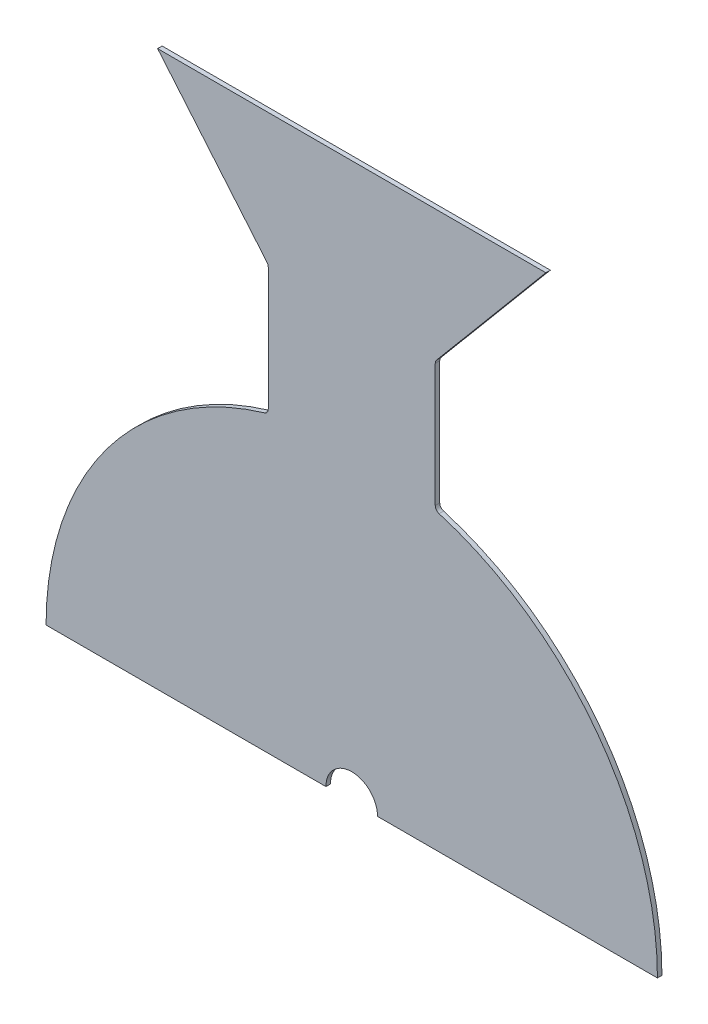
ISO-10303-21;
HEADER;
FILE_DESCRIPTION(('STEP AP214'),'2;1');
FILE_NAME('part.step','',(''),(''),'','','');
FILE_SCHEMA(('AUTOMOTIVE_DESIGN { 1 0 10303 214 1 1 1 1 }'));
ENDSEC;
DATA;
#1=APPLICATION_CONTEXT('core data for automotive mechanical design processes');
#2=APPLICATION_PROTOCOL_DEFINITION('international standard','automotive_design',2000,#1);
#3=PRODUCT_CONTEXT('',#1,'mechanical');
#4=PRODUCT('Part','Part','',(#3));
#5=PRODUCT_RELATED_PRODUCT_CATEGORY('part','',(#4));
#6=PRODUCT_DEFINITION_FORMATION('','',#4);
#7=PRODUCT_DEFINITION_CONTEXT('part definition',#1,'design');
#8=PRODUCT_DEFINITION('design','',#6,#7);
#9=PRODUCT_DEFINITION_SHAPE('','',#8);
#10=(LENGTH_UNIT() NAMED_UNIT(*) SI_UNIT(.MILLI.,.METRE.));
#11=(NAMED_UNIT(*) PLANE_ANGLE_UNIT() SI_UNIT($,.RADIAN.));
#12=(NAMED_UNIT(*) SI_UNIT($,.STERADIAN.) SOLID_ANGLE_UNIT());
#13=UNCERTAINTY_MEASURE_WITH_UNIT(LENGTH_MEASURE(1.E-05),#10,'distance_accuracy_value','');
#14=(GEOMETRIC_REPRESENTATION_CONTEXT(3) GLOBAL_UNCERTAINTY_ASSIGNED_CONTEXT((#13)) GLOBAL_UNIT_ASSIGNED_CONTEXT((#10,
#11,#12)) REPRESENTATION_CONTEXT('',''));
#15=CARTESIAN_POINT('',(0.,0.,0.));
#16=DIRECTION('',(0.,0.,1.));
#17=DIRECTION('',(1.,0.,0.));
#18=AXIS2_PLACEMENT_3D('',#15,#16,#17);
#19=CARTESIAN_POINT('',(0.,0.,-2.65684));
#20=DIRECTION('',(0.,0.,1.));
#21=DIRECTION('',(1.,0.,0.));
#22=AXIS2_PLACEMENT_3D('',#19,#20,#21);
#23=CYLINDRICAL_SURFACE('',#22,180.45684);
#24=CARTESIAN_POINT('',(0.,0.,0.));
#25=DIRECTION('',(0.,0.,1.));
#26=DIRECTION('',(-1.,0.,0.));
#27=AXIS2_PLACEMENT_3D('',#24,#25,#26);
#28=CIRCLE('',#27,180.45684);
#29=CARTESIAN_POINT('',(-51.5590971428571,172.934469104916,0.));
#30=VERTEX_POINT('',#29);
#31=CARTESIAN_POINT('',(-180.45684,0.,0.));
#32=VERTEX_POINT('',#31);
#33=EDGE_CURVE('E182',#30,#32,#28,.T.);
#34=ORIENTED_EDGE('',*,*,#33,.F.);
#35=DIRECTION('',(0.,0.,1.));
#36=VECTOR('',#35,1.);
#37=CARTESIAN_POINT('',(-51.5590971428571,172.934469104916,-2.65684));
#38=LINE('',#37,#36);
#39=CARTESIAN_POINT('',(-51.5590971428571,172.934469104916,-2.65684));
#40=VERTEX_POINT('',#39);
#41=EDGE_CURVE('E55',#30,#40,#38,.F.);
#42=ORIENTED_EDGE('',*,*,#41,.T.);
#43=CARTESIAN_POINT('',(0.,0.,-2.65684));
#44=DIRECTION('',(0.,0.,1.));
#45=DIRECTION('',(-1.,0.,0.));
#46=AXIS2_PLACEMENT_3D('',#43,#44,#45);
#47=CIRCLE('',#46,180.45684);
#48=CARTESIAN_POINT('',(-180.45684,0.,-2.65684));
#49=VERTEX_POINT('',#48);
#50=EDGE_CURVE('E137',#40,#49,#47,.T.);
#51=ORIENTED_EDGE('',*,*,#50,.T.);
#52=DIRECTION('',(0.,0.,1.));
#53=VECTOR('',#52,1.);
#54=CARTESIAN_POINT('',(-180.45684,0.,-2.65684));
#55=LINE('',#54,#53);
#56=EDGE_CURVE('E139',#49,#32,#55,.T.);
#57=ORIENTED_EDGE('',*,*,#56,.T.);
#58=EDGE_LOOP('',(#34,#42,#51,#57));
#59=FACE_BOUND('',#58,.T.);
#60=ADVANCED_FACE('F40',(#59),#23,.T.);
#61=CARTESIAN_POINT('',(-49.29124,173.594483674015,-2.65684));
#62=DIRECTION('',(-1.,0.,0.));
#63=DIRECTION('',(0.,0.,1.));
#64=AXIS2_PLACEMENT_3D('',#61,#62,#63);
#65=PLANE('',#64);
#66=DIRECTION('',(0.,-1.,0.));
#67=VECTOR('',#66,1.);
#68=CARTESIAN_POINT('',(-49.29124,173.594483674015,0.));
#69=LINE('',#68,#67);
#70=CARTESIAN_POINT('',(-49.29124,248.63887818022,0.));
#71=VERTEX_POINT('',#70);
#72=CARTESIAN_POINT('',(-49.29124,175.977118745728,0.));
#73=VERTEX_POINT('',#72);
#74=EDGE_CURVE('E145',#71,#73,#69,.T.);
#75=ORIENTED_EDGE('',*,*,#74,.F.);
#76=DIRECTION('',(0.,0.,1.));
#77=VECTOR('',#76,1.);
#78=CARTESIAN_POINT('',(-49.29124,248.63887818022,-2.65684));
#79=LINE('',#78,#77);
#80=CARTESIAN_POINT('',(-49.29124,248.63887818022,-2.65684));
#81=VERTEX_POINT('',#80);
#82=EDGE_CURVE('E222',#71,#81,#79,.F.);
#83=ORIENTED_EDGE('',*,*,#82,.T.);
#84=DIRECTION('',(0.,-1.,0.));
#85=VECTOR('',#84,1.);
#86=CARTESIAN_POINT('',(-49.29124,173.594483674015,-2.65684));
#87=LINE('',#86,#85);
#88=CARTESIAN_POINT('',(-49.29124,175.977118745728,-2.65684));
#89=VERTEX_POINT('',#88);
#90=EDGE_CURVE('E153',#81,#89,#87,.T.);
#91=ORIENTED_EDGE('',*,*,#90,.T.);
#92=DIRECTION('',(0.,0.,-1.));
#93=VECTOR('',#92,1.);
#94=CARTESIAN_POINT('',(-49.29124,175.977118745728,0.));
#95=LINE('',#94,#93);
#96=EDGE_CURVE('E219',#89,#73,#95,.F.);
#97=ORIENTED_EDGE('',*,*,#96,.T.);
#98=EDGE_LOOP('',(#75,#83,#91,#97));
#99=FACE_BOUND('',#98,.T.);
#100=ADVANCED_FACE('F279',(#99),#65,.T.);
#101=CARTESIAN_POINT('',(-49.29124,249.794483674015,-2.65684));
#102=DIRECTION('',(-0.766044443118977,-0.642787609686541,0.));
#103=DIRECTION('',(0.642787609686541,-0.766044443118977,0.));
#104=AXIS2_PLACEMENT_3D('',#101,#102,#103);
#105=PLANE('',#104);
#106=DIRECTION('',(0.642787609686541,-0.766044443118977,0.));
#107=VECTOR('',#106,1.);
#108=CARTESIAN_POINT('',(-49.29124,249.794483674015,-2.65684));
#109=LINE('',#108,#107);
#110=CARTESIAN_POINT('',(-114.598461144153,327.624599094903,-2.65684));
#111=VERTEX_POINT('',#110);
#112=CARTESIAN_POINT('',(-50.0340488930973,250.679728840975,-2.65684));
#113=VERTEX_POINT('',#112);
#114=EDGE_CURVE('E177',#111,#113,#109,.T.);
#115=ORIENTED_EDGE('',*,*,#114,.T.);
#116=DIRECTION('',(0.,0.,1.));
#117=VECTOR('',#116,1.);
#118=CARTESIAN_POINT('',(-50.0340488930972,250.679728840975,0.));
#119=LINE('',#118,#117);
#120=CARTESIAN_POINT('',(-50.0340488930973,250.679728840975,0.));
#121=VERTEX_POINT('',#120);
#122=EDGE_CURVE('E208',#113,#121,#119,.T.);
#123=ORIENTED_EDGE('',*,*,#122,.T.);
#124=DIRECTION('',(0.642787609686541,-0.766044443118977,0.));
#125=VECTOR('',#124,1.);
#126=CARTESIAN_POINT('',(-49.29124,249.794483674015,0.));
#127=LINE('',#126,#125);
#128=CARTESIAN_POINT('',(-114.598461144153,327.624599094903,0.));
#129=VERTEX_POINT('',#128);
#130=EDGE_CURVE('E202',#129,#121,#127,.T.);
#131=ORIENTED_EDGE('',*,*,#130,.F.);
#132=DIRECTION('',(0.,0.,1.));
#133=VECTOR('',#132,1.);
#134=CARTESIAN_POINT('',(-114.598461144153,327.624599094903,-2.65684));
#135=LINE('',#134,#133);
#136=EDGE_CURVE('E206',#111,#129,#135,.T.);
#137=ORIENTED_EDGE('',*,*,#136,.F.);
#138=EDGE_LOOP('',(#115,#123,#131,#137));
#139=FACE_BOUND('',#138,.T.);
#140=ADVANCED_FACE('F270',(#139),#105,.T.);
#141=CARTESIAN_POINT('',(-114.598461144153,327.624599094903,-2.65684));
#142=DIRECTION('',(0.,1.,0.));
#143=DIRECTION('',(0.,0.,1.));
#144=AXIS2_PLACEMENT_3D('',#141,#142,#143);
#145=PLANE('',#144);
#146=DIRECTION('',(-1.,0.,0.));
#147=VECTOR('',#146,1.);
#148=CARTESIAN_POINT('',(-114.598461144153,327.624599094903,0.));
#149=LINE('',#148,#147);
#150=CARTESIAN_POINT('',(114.598461144153,327.624599094903,0.));
#151=VERTEX_POINT('',#150);
#152=EDGE_CURVE('E199',#151,#129,#149,.T.);
#153=ORIENTED_EDGE('',*,*,#152,.F.);
#154=DIRECTION('',(0.,0.,1.));
#155=VECTOR('',#154,1.);
#156=CARTESIAN_POINT('',(114.598461144153,327.624599094903,-2.65684));
#157=LINE('',#156,#155);
#158=CARTESIAN_POINT('',(114.598461144153,327.624599094903,-2.65684));
#159=VERTEX_POINT('',#158);
#160=EDGE_CURVE('E209',#159,#151,#157,.T.);
#161=ORIENTED_EDGE('',*,*,#160,.F.);
#162=DIRECTION('',(-1.,0.,0.));
#163=VECTOR('',#162,1.);
#164=CARTESIAN_POINT('',(-114.598461144153,327.624599094903,-2.65684));
#165=LINE('',#164,#163);
#166=EDGE_CURVE('E174',#159,#111,#165,.T.);
#167=ORIENTED_EDGE('',*,*,#166,.T.);
#168=ORIENTED_EDGE('',*,*,#136,.T.);
#169=EDGE_LOOP('',(#153,#161,#167,#168));
#170=FACE_BOUND('',#169,.T.);
#171=ADVANCED_FACE('F266',(#170),#145,.T.);
#172=CARTESIAN_POINT('',(49.29124,249.794483674015,-2.65684));
#173=DIRECTION('',(0.766044443118977,-0.642787609686541,0.));
#174=DIRECTION('',(0.642787609686541,0.766044443118977,0.));
#175=AXIS2_PLACEMENT_3D('',#172,#173,#174);
#176=PLANE('',#175);
#177=DIRECTION('',(0.642787609686541,0.766044443118977,0.));
#178=VECTOR('',#177,1.);
#179=CARTESIAN_POINT('',(49.29124,249.794483674015,0.));
#180=LINE('',#179,#178);
#181=CARTESIAN_POINT('',(50.0340488930973,250.679728840975,0.));
#182=VERTEX_POINT('',#181);
#183=EDGE_CURVE('E197',#182,#151,#180,.T.);
#184=ORIENTED_EDGE('',*,*,#183,.F.);
#185=DIRECTION('',(0.,0.,1.));
#186=VECTOR('',#185,1.);
#187=CARTESIAN_POINT('',(50.0340488930972,250.679728840975,-2.65684));
#188=LINE('',#187,#186);
#189=CARTESIAN_POINT('',(50.0340488930973,250.679728840975,-2.65684));
#190=VERTEX_POINT('',#189);
#191=EDGE_CURVE('E232',#182,#190,#188,.F.);
#192=ORIENTED_EDGE('',*,*,#191,.T.);
#193=DIRECTION('',(0.642787609686541,0.766044443118977,0.));
#194=VECTOR('',#193,1.);
#195=CARTESIAN_POINT('',(49.29124,249.794483674015,-2.65684));
#196=LINE('',#195,#194);
#197=EDGE_CURVE('E172',#190,#159,#196,.T.);
#198=ORIENTED_EDGE('',*,*,#197,.T.);
#199=ORIENTED_EDGE('',*,*,#160,.T.);
#200=EDGE_LOOP('',(#184,#192,#198,#199));
#201=FACE_BOUND('',#200,.T.);
#202=ADVANCED_FACE('F262',(#201),#176,.T.);
#203=CARTESIAN_POINT('',(49.29124,173.594483674015,-2.65684));
#204=DIRECTION('',(1.,0.,0.));
#205=DIRECTION('',(0.,0.,-1.));
#206=AXIS2_PLACEMENT_3D('',#203,#204,#205);
#207=PLANE('',#206);
#208=DIRECTION('',(0.,1.,0.));
#209=VECTOR('',#208,1.);
#210=CARTESIAN_POINT('',(49.29124,173.594483674015,0.));
#211=LINE('',#210,#209);
#212=CARTESIAN_POINT('',(49.29124,175.977118745728,0.));
#213=VERTEX_POINT('',#212);
#214=CARTESIAN_POINT('',(49.29124,248.63887818022,0.));
#215=VERTEX_POINT('',#214);
#216=EDGE_CURVE('E194',#213,#215,#211,.T.);
#217=ORIENTED_EDGE('',*,*,#216,.F.);
#218=DIRECTION('',(0.,0.,-1.));
#219=VECTOR('',#218,1.);
#220=CARTESIAN_POINT('',(49.29124,175.977118745728,-2.65684));
#221=LINE('',#220,#219);
#222=CARTESIAN_POINT('',(49.29124,175.977118745728,-2.65684));
#223=VERTEX_POINT('',#222);
#224=EDGE_CURVE('E230',#213,#223,#221,.T.);
#225=ORIENTED_EDGE('',*,*,#224,.T.);
#226=DIRECTION('',(0.,1.,0.));
#227=VECTOR('',#226,1.);
#228=CARTESIAN_POINT('',(49.29124,173.594483674015,-2.65684));
#229=LINE('',#228,#227);
#230=CARTESIAN_POINT('',(49.29124,248.63887818022,-2.65684));
#231=VERTEX_POINT('',#230);
#232=EDGE_CURVE('E169',#223,#231,#229,.T.);
#233=ORIENTED_EDGE('',*,*,#232,.T.);
#234=DIRECTION('',(0.,0.,1.));
#235=VECTOR('',#234,1.);
#236=CARTESIAN_POINT('',(49.29124,248.63887818022,0.));
#237=LINE('',#236,#235);
#238=EDGE_CURVE('E227',#231,#215,#237,.T.);
#239=ORIENTED_EDGE('',*,*,#238,.T.);
#240=EDGE_LOOP('',(#217,#225,#233,#239));
#241=FACE_BOUND('',#240,.T.);
#242=ADVANCED_FACE('F256',(#241),#207,.T.);
#243=CARTESIAN_POINT('',(0.,0.,-2.65684));
#244=DIRECTION('',(0.,0.,1.));
#245=DIRECTION('',(1.,0.,0.));
#246=AXIS2_PLACEMENT_3D('',#243,#244,#245);
#247=CYLINDRICAL_SURFACE('',#246,180.45684);
#248=CARTESIAN_POINT('',(0.,0.,-2.65684));
#249=DIRECTION('',(0.,0.,1.));
#250=DIRECTION('',(-1.,0.,0.));
#251=AXIS2_PLACEMENT_3D('',#248,#249,#250);
#252=CIRCLE('',#251,180.45684);
#253=CARTESIAN_POINT('',(180.45684,0.,-2.65684));
#254=VERTEX_POINT('',#253);
#255=CARTESIAN_POINT('',(51.5590971428571,172.934469104916,-2.65684));
#256=VERTEX_POINT('',#255);
#257=EDGE_CURVE('E166',#254,#256,#252,.T.);
#258=ORIENTED_EDGE('',*,*,#257,.T.);
#259=DIRECTION('',(0.,0.,1.));
#260=VECTOR('',#259,1.);
#261=CARTESIAN_POINT('',(51.5590971428571,172.934469104916,-2.65684));
#262=LINE('',#261,#260);
#263=CARTESIAN_POINT('',(51.5590971428571,172.934469104916,0.));
#264=VERTEX_POINT('',#263);
#265=EDGE_CURVE('E224',#256,#264,#262,.T.);
#266=ORIENTED_EDGE('',*,*,#265,.T.);
#267=CARTESIAN_POINT('',(0.,0.,0.));
#268=DIRECTION('',(0.,0.,1.));
#269=DIRECTION('',(-1.,0.,0.));
#270=AXIS2_PLACEMENT_3D('',#267,#268,#269);
#271=CIRCLE('',#270,180.45684);
#272=CARTESIAN_POINT('',(180.45684,0.,0.));
#273=VERTEX_POINT('',#272);
#274=EDGE_CURVE('E191',#273,#264,#271,.T.);
#275=ORIENTED_EDGE('',*,*,#274,.F.);
#276=DIRECTION('',(0.,0.,1.));
#277=VECTOR('',#276,1.);
#278=CARTESIAN_POINT('',(180.45684,0.,-2.65684));
#279=LINE('',#278,#277);
#280=EDGE_CURVE('E212',#254,#273,#279,.T.);
#281=ORIENTED_EDGE('',*,*,#280,.F.);
#282=EDGE_LOOP('',(#258,#266,#275,#281));
#283=FACE_BOUND('',#282,.T.);
#284=ADVANCED_FACE('F305',(#283),#247,.T.);
#285=CARTESIAN_POINT('',(15.24,0.,-2.65684));
#286=DIRECTION('',(0.,-1.,0.));
#287=DIRECTION('',(1.,0.,0.));
#288=AXIS2_PLACEMENT_3D('',#285,#286,#287);
#289=PLANE('',#288);
#290=DIRECTION('',(1.,0.,0.));
#291=VECTOR('',#290,1.);
#292=CARTESIAN_POINT('',(15.24,0.,0.));
#293=LINE('',#292,#291);
#294=CARTESIAN_POINT('',(15.24,0.,0.));
#295=VERTEX_POINT('',#294);
#296=EDGE_CURVE('E188',#295,#273,#293,.T.);
#297=ORIENTED_EDGE('',*,*,#296,.F.);
#298=DIRECTION('',(0.,0.,1.));
#299=VECTOR('',#298,1.);
#300=CARTESIAN_POINT('',(15.24,0.,-2.65684));
#301=LINE('',#300,#299);
#302=CARTESIAN_POINT('',(15.24,0.,-2.65684));
#303=VERTEX_POINT('',#302);
#304=EDGE_CURVE('E214',#303,#295,#301,.T.);
#305=ORIENTED_EDGE('',*,*,#304,.F.);
#306=DIRECTION('',(1.,0.,0.));
#307=VECTOR('',#306,1.);
#308=CARTESIAN_POINT('',(15.24,0.,-2.65684));
#309=LINE('',#308,#307);
#310=EDGE_CURVE('E161',#303,#254,#309,.T.);
#311=ORIENTED_EDGE('',*,*,#310,.T.);
#312=ORIENTED_EDGE('',*,*,#280,.T.);
#313=EDGE_LOOP('',(#297,#305,#311,#312));
#314=FACE_BOUND('',#313,.T.);
#315=ADVANCED_FACE('F309',(#314),#289,.T.);
#316=CARTESIAN_POINT('',(0.,0.,-2.65684));
#317=DIRECTION('',(0.,0.,1.));
#318=DIRECTION('',(1.,0.,0.));
#319=AXIS2_PLACEMENT_3D('',#316,#317,#318);
#320=CYLINDRICAL_SURFACE('',#319,15.24);
#321=CARTESIAN_POINT('',(0.,0.,0.));
#322=DIRECTION('',(0.,0.,-1.));
#323=DIRECTION('',(-1.,0.,0.));
#324=AXIS2_PLACEMENT_3D('',#321,#322,#323);
#325=CIRCLE('',#324,15.24);
#326=CARTESIAN_POINT('',(-15.24,0.,0.));
#327=VERTEX_POINT('',#326);
#328=EDGE_CURVE('E185',#327,#295,#325,.T.);
#329=ORIENTED_EDGE('',*,*,#328,.F.);
#330=DIRECTION('',(0.,0.,1.));
#331=VECTOR('',#330,1.);
#332=CARTESIAN_POINT('',(-15.24,0.,-2.65684));
#333=LINE('',#332,#331);
#334=CARTESIAN_POINT('',(-15.24,0.,-2.65684));
#335=VERTEX_POINT('',#334);
#336=EDGE_CURVE('E152',#335,#327,#333,.T.);
#337=ORIENTED_EDGE('',*,*,#336,.F.);
#338=CARTESIAN_POINT('',(0.,0.,-2.65684));
#339=DIRECTION('',(0.,0.,-1.));
#340=DIRECTION('',(-1.,0.,0.));
#341=AXIS2_PLACEMENT_3D('',#338,#339,#340);
#342=CIRCLE('',#341,15.24);
#343=EDGE_CURVE('E159',#335,#303,#342,.T.);
#344=ORIENTED_EDGE('',*,*,#343,.T.);
#345=ORIENTED_EDGE('',*,*,#304,.T.);
#346=EDGE_LOOP('',(#329,#337,#344,#345));
#347=FACE_BOUND('',#346,.T.);
#348=ADVANCED_FACE('F312',(#347),#320,.F.);
#349=CARTESIAN_POINT('',(-180.45684,0.,-2.65684));
#350=DIRECTION('',(0.,-1.,0.));
#351=DIRECTION('',(1.,0.,0.));
#352=AXIS2_PLACEMENT_3D('',#349,#350,#351);
#353=PLANE('',#352);
#354=DIRECTION('',(1.,0.,0.));
#355=VECTOR('',#354,1.);
#356=CARTESIAN_POINT('',(-180.45684,0.,0.));
#357=LINE('',#356,#355);
#358=EDGE_CURVE('E151',#32,#327,#357,.T.);
#359=ORIENTED_EDGE('',*,*,#358,.F.);
#360=ORIENTED_EDGE('',*,*,#56,.F.);
#361=DIRECTION('',(1.,0.,0.));
#362=VECTOR('',#361,1.);
#363=CARTESIAN_POINT('',(-180.45684,0.,-2.65684));
#364=LINE('',#363,#362);
#365=EDGE_CURVE('E144',#49,#335,#364,.T.);
#366=ORIENTED_EDGE('',*,*,#365,.T.);
#367=ORIENTED_EDGE('',*,*,#336,.T.);
#368=EDGE_LOOP('',(#359,#360,#366,#367));
#369=FACE_BOUND('',#368,.T.);
#370=ADVANCED_FACE('F149',(#369),#353,.T.);
#371=CARTESIAN_POINT('',(0.,0.,-2.65684));
#372=DIRECTION('',(0.,0.,-1.));
#373=DIRECTION('',(-1.,0.,0.));
#374=AXIS2_PLACEMENT_3D('',#371,#372,#373);
#375=PLANE('',#374);
#376=ORIENTED_EDGE('',*,*,#50,.F.);
#377=CARTESIAN_POINT('',(-52.46624,175.977118745728,-2.65684));
#378=DIRECTION('',(0.,0.,-1.));
#379=DIRECTION('',(-1.,0.,0.));
#380=AXIS2_PLACEMENT_3D('',#377,#378,#379);
#381=CIRCLE('',#380,3.175);
#382=EDGE_CURVE('E11',#40,#89,#381,.F.);
#383=ORIENTED_EDGE('',*,*,#382,.T.);
#384=ORIENTED_EDGE('',*,*,#90,.F.);
#385=CARTESIAN_POINT('',(-52.46624,248.63887818022,-2.65684));
#386=DIRECTION('',(0.,0.,-1.));
#387=DIRECTION('',(-1.,0.,0.));
#388=AXIS2_PLACEMENT_3D('',#385,#386,#387);
#389=CIRCLE('',#388,3.175);
#390=EDGE_CURVE('E237',#81,#113,#389,.F.);
#391=ORIENTED_EDGE('',*,*,#390,.T.);
#392=ORIENTED_EDGE('',*,*,#114,.F.);
#393=ORIENTED_EDGE('',*,*,#166,.F.);
#394=ORIENTED_EDGE('',*,*,#197,.F.);
#395=CARTESIAN_POINT('',(52.46624,248.63887818022,-2.65684));
#396=DIRECTION('',(0.,0.,-1.));
#397=DIRECTION('',(-1.,0.,0.));
#398=AXIS2_PLACEMENT_3D('',#395,#396,#397);
#399=CIRCLE('',#398,3.175);
#400=EDGE_CURVE('E245',#190,#231,#399,.F.);
#401=ORIENTED_EDGE('',*,*,#400,.T.);
#402=ORIENTED_EDGE('',*,*,#232,.F.);
#403=CARTESIAN_POINT('',(52.46624,175.977118745728,-2.65684));
#404=DIRECTION('',(0.,0.,-1.));
#405=DIRECTION('',(-1.,0.,0.));
#406=AXIS2_PLACEMENT_3D('',#403,#404,#405);
#407=CIRCLE('',#406,3.175);
#408=EDGE_CURVE('E241',#223,#256,#407,.F.);
#409=ORIENTED_EDGE('',*,*,#408,.T.);
#410=ORIENTED_EDGE('',*,*,#257,.F.);
#411=ORIENTED_EDGE('',*,*,#310,.F.);
#412=ORIENTED_EDGE('',*,*,#343,.F.);
#413=ORIENTED_EDGE('',*,*,#365,.F.);
#414=EDGE_LOOP('',(#376,#383,#384,#391,#392,#393,#394,#401,#402,#409,#410,#411,#412,#413));
#415=FACE_BOUND('',#414,.T.);
#416=ADVANCED_FACE('F156',(#415),#375,.T.);
#417=CARTESIAN_POINT('',(0.,0.,0.));
#418=DIRECTION('',(0.,0.,-1.));
#419=DIRECTION('',(-1.,0.,0.));
#420=AXIS2_PLACEMENT_3D('',#417,#418,#419);
#421=PLANE('',#420);
#422=ORIENTED_EDGE('',*,*,#74,.T.);
#423=CARTESIAN_POINT('',(-52.46624,175.977118745728,0.));
#424=DIRECTION('',(0.,0.,-1.));
#425=DIRECTION('',(-1.,0.,0.));
#426=AXIS2_PLACEMENT_3D('',#423,#424,#425);
#427=CIRCLE('',#426,3.175);
#428=EDGE_CURVE('E48',#73,#30,#427,.T.);
#429=ORIENTED_EDGE('',*,*,#428,.T.);
#430=ORIENTED_EDGE('',*,*,#33,.T.);
#431=ORIENTED_EDGE('',*,*,#358,.T.);
#432=ORIENTED_EDGE('',*,*,#328,.T.);
#433=ORIENTED_EDGE('',*,*,#296,.T.);
#434=ORIENTED_EDGE('',*,*,#274,.T.);
#435=CARTESIAN_POINT('',(52.46624,175.977118745728,0.));
#436=DIRECTION('',(0.,0.,-1.));
#437=DIRECTION('',(-1.,0.,0.));
#438=AXIS2_PLACEMENT_3D('',#435,#436,#437);
#439=CIRCLE('',#438,3.175);
#440=EDGE_CURVE('E239',#264,#213,#439,.T.);
#441=ORIENTED_EDGE('',*,*,#440,.T.);
#442=ORIENTED_EDGE('',*,*,#216,.T.);
#443=CARTESIAN_POINT('',(52.46624,248.63887818022,0.));
#444=DIRECTION('',(0.,0.,-1.));
#445=DIRECTION('',(-1.,0.,0.));
#446=AXIS2_PLACEMENT_3D('',#443,#444,#445);
#447=CIRCLE('',#446,3.175);
#448=EDGE_CURVE('E243',#215,#182,#447,.T.);
#449=ORIENTED_EDGE('',*,*,#448,.T.);
#450=ORIENTED_EDGE('',*,*,#183,.T.);
#451=ORIENTED_EDGE('',*,*,#152,.T.);
#452=ORIENTED_EDGE('',*,*,#130,.T.);
#453=CARTESIAN_POINT('',(-52.46624,248.63887818022,0.));
#454=DIRECTION('',(0.,0.,-1.));
#455=DIRECTION('',(-1.,0.,0.));
#456=AXIS2_PLACEMENT_3D('',#453,#454,#455);
#457=CIRCLE('',#456,3.175);
#458=EDGE_CURVE('E235',#121,#71,#457,.T.);
#459=ORIENTED_EDGE('',*,*,#458,.T.);
#460=EDGE_LOOP('',(#422,#429,#430,#431,#432,#433,#434,#441,#442,#449,#450,#451,#452,#459));
#461=FACE_BOUND('',#460,.T.);
#462=ADVANCED_FACE('F260',(#461),#421,.F.);
#463=CARTESIAN_POINT('',(-52.46624,248.63887818022,-2.65684));
#464=DIRECTION('',(0.,0.,-1.));
#465=DIRECTION('',(-1.,0.,0.));
#466=AXIS2_PLACEMENT_3D('',#463,#464,#465);
#467=CYLINDRICAL_SURFACE('',#466,3.175);
#468=ORIENTED_EDGE('',*,*,#390,.F.);
#469=ORIENTED_EDGE('',*,*,#82,.F.);
#470=ORIENTED_EDGE('',*,*,#458,.F.);
#471=ORIENTED_EDGE('',*,*,#122,.F.);
#472=EDGE_LOOP('',(#468,#469,#470,#471));
#473=FACE_BOUND('',#472,.T.);
#474=ADVANCED_FACE('F275',(#473),#467,.F.);
#475=CARTESIAN_POINT('',(52.46624,175.977118745728,-2.65684));
#476=DIRECTION('',(0.,0.,1.));
#477=DIRECTION('',(1.,0.,0.));
#478=AXIS2_PLACEMENT_3D('',#475,#476,#477);
#479=CYLINDRICAL_SURFACE('',#478,3.175);
#480=ORIENTED_EDGE('',*,*,#408,.F.);
#481=ORIENTED_EDGE('',*,*,#224,.F.);
#482=ORIENTED_EDGE('',*,*,#440,.F.);
#483=ORIENTED_EDGE('',*,*,#265,.F.);
#484=EDGE_LOOP('',(#480,#481,#482,#483));
#485=FACE_BOUND('',#484,.T.);
#486=ADVANCED_FACE('F286',(#485),#479,.F.);
#487=CARTESIAN_POINT('',(52.46624,248.63887818022,-2.65684));
#488=DIRECTION('',(0.,0.,-1.));
#489=DIRECTION('',(-1.,0.,0.));
#490=AXIS2_PLACEMENT_3D('',#487,#488,#489);
#491=CYLINDRICAL_SURFACE('',#490,3.175);
#492=ORIENTED_EDGE('',*,*,#400,.F.);
#493=ORIENTED_EDGE('',*,*,#191,.F.);
#494=ORIENTED_EDGE('',*,*,#448,.F.);
#495=ORIENTED_EDGE('',*,*,#238,.F.);
#496=EDGE_LOOP('',(#492,#493,#494,#495));
#497=FACE_BOUND('',#496,.T.);
#498=ADVANCED_FACE('F258',(#497),#491,.F.);
#499=CARTESIAN_POINT('',(-52.46624,175.977118745728,-2.65684));
#500=DIRECTION('',(0.,0.,1.));
#501=DIRECTION('',(1.,0.,0.));
#502=AXIS2_PLACEMENT_3D('',#499,#500,#501);
#503=CYLINDRICAL_SURFACE('',#502,3.175);
#504=ORIENTED_EDGE('',*,*,#382,.F.);
#505=ORIENTED_EDGE('',*,*,#41,.F.);
#506=ORIENTED_EDGE('',*,*,#428,.F.);
#507=ORIENTED_EDGE('',*,*,#96,.F.);
#508=EDGE_LOOP('',(#504,#505,#506,#507));
#509=FACE_BOUND('',#508,.T.);
#510=ADVANCED_FACE('F42',(#509),#503,.F.);
#511=CLOSED_SHELL('',(#60,#100,#140,#171,#202,#242,#284,#315,#348,#370,#416,#462,#474,#486,#498,#510));
#512=MANIFOLD_SOLID_BREP('B2',#511);
#513=ADVANCED_BREP_SHAPE_REPRESENTATION('',(#18,#512),#14);
#514=SHAPE_DEFINITION_REPRESENTATION(#9,#513);
ENDSEC;
END-ISO-10303-21;
